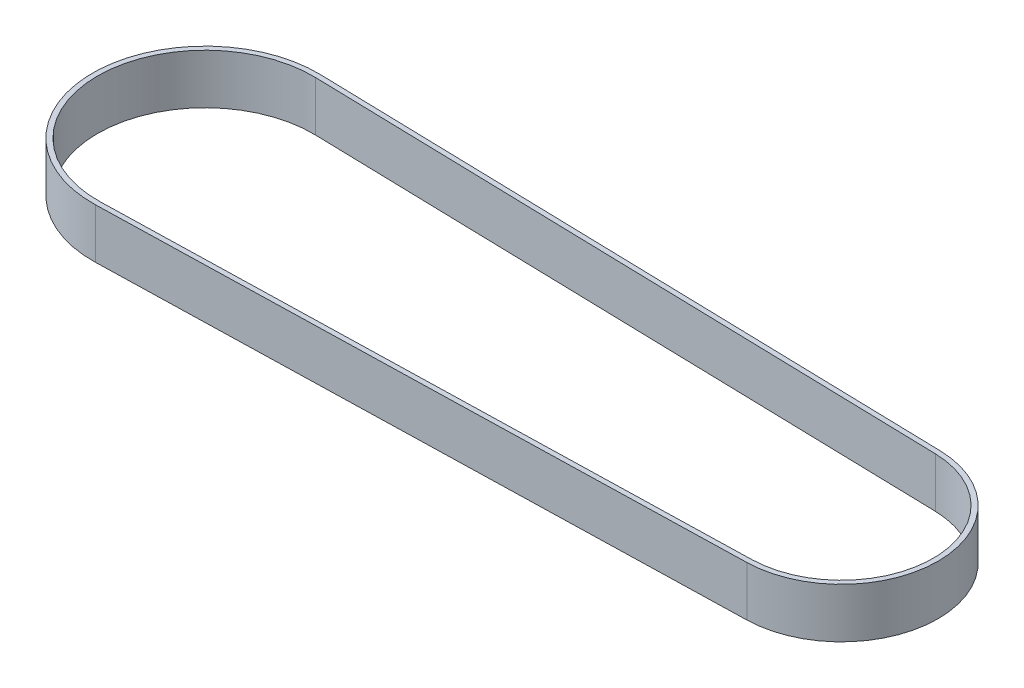
ISO-10303-21;
HEADER;
FILE_DESCRIPTION(('STEP AP214'),'2;1');
FILE_NAME('part.step','',(''),(''),'','','');
FILE_SCHEMA(('AUTOMOTIVE_DESIGN { 1 0 10303 214 1 1 1 1 }'));
ENDSEC;
DATA;
#1=APPLICATION_CONTEXT('core data for automotive mechanical design processes');
#2=APPLICATION_PROTOCOL_DEFINITION('international standard','automotive_design',2000,#1);
#3=PRODUCT_CONTEXT('',#1,'mechanical');
#4=PRODUCT('Part','Part','',(#3));
#5=PRODUCT_RELATED_PRODUCT_CATEGORY('part','',(#4));
#6=PRODUCT_DEFINITION_FORMATION('','',#4);
#7=PRODUCT_DEFINITION_CONTEXT('part definition',#1,'design');
#8=PRODUCT_DEFINITION('design','',#6,#7);
#9=PRODUCT_DEFINITION_SHAPE('','',#8);
#10=(LENGTH_UNIT() NAMED_UNIT(*) SI_UNIT(.MILLI.,.METRE.));
#11=(NAMED_UNIT(*) PLANE_ANGLE_UNIT() SI_UNIT($,.RADIAN.));
#12=(NAMED_UNIT(*) SI_UNIT($,.STERADIAN.) SOLID_ANGLE_UNIT());
#13=UNCERTAINTY_MEASURE_WITH_UNIT(LENGTH_MEASURE(1.E-05),#10,'distance_accuracy_value','');
#14=(GEOMETRIC_REPRESENTATION_CONTEXT(3) GLOBAL_UNCERTAINTY_ASSIGNED_CONTEXT((#13)) GLOBAL_UNIT_ASSIGNED_CONTEXT((#10,
#11,#12)) REPRESENTATION_CONTEXT('',''));
#15=CARTESIAN_POINT('',(0.,0.,0.));
#16=DIRECTION('',(0.,0.,1.));
#17=DIRECTION('',(1.,0.,0.));
#18=AXIS2_PLACEMENT_3D('',#15,#16,#17);
#19=CARTESIAN_POINT('',(0.,10.,0.));
#20=DIRECTION('',(0.,1.,0.));
#21=DIRECTION('',(0.,0.,1.));
#22=AXIS2_PLACEMENT_3D('',#19,#20,#21);
#23=PLANE('',#22);
#24=CARTESIAN_POINT('',(0.,10.,0.));
#25=DIRECTION('',(0.,1.,0.));
#26=DIRECTION('',(0.,0.,1.));
#27=AXIS2_PLACEMENT_3D('',#24,#25,#26);
#28=CIRCLE('',#27,22.6);
#29=CARTESIAN_POINT('',(0.566637937788921,10.,-22.5928953754816));
#30=VERTEX_POINT('',#29);
#31=CARTESIAN_POINT('',(0.566637937788921,10.,22.5928953754816));
#32=VERTEX_POINT('',#31);
#33=EDGE_CURVE('E153',#30,#32,#28,.T.);
#34=ORIENTED_EDGE('',*,*,#33,.T.);
#35=DIRECTION('',(0.999685636083257,0.,-0.0250724751234036));
#36=VECTOR('',#35,1.);
#37=CARTESIAN_POINT('',(0.566637937788921,10.,22.5928953754816));
#38=LINE('',#37,#36);
#39=CARTESIAN_POINT('',(128.116406017394,10.,19.3939013400152));
#40=VERTEX_POINT('',#39);
#41=EDGE_CURVE('E157',#32,#40,#38,.T.);
#42=ORIENTED_EDGE('',*,*,#41,.T.);
#43=CARTESIAN_POINT('',(127.63,10.,0.));
#44=DIRECTION('',(0.,1.,0.));
#45=DIRECTION('',(0.,0.,1.));
#46=AXIS2_PLACEMENT_3D('',#43,#44,#45);
#47=CIRCLE('',#46,19.4);
#48=CARTESIAN_POINT('',(128.116406017394,10.,-19.3939013400152));
#49=VERTEX_POINT('',#48);
#50=EDGE_CURVE('E161',#40,#49,#47,.T.);
#51=ORIENTED_EDGE('',*,*,#50,.T.);
#52=DIRECTION('',(-0.999685636083257,0.,-0.0250724751234036));
#53=VECTOR('',#52,1.);
#54=CARTESIAN_POINT('',(0.566637937788921,10.,-22.5928953754816));
#55=LINE('',#54,#53);
#56=EDGE_CURVE('E164',#49,#30,#55,.T.);
#57=ORIENTED_EDGE('',*,*,#56,.T.);
#58=EDGE_LOOP('',(#34,#42,#51,#57));
#59=FACE_BOUND('',#58,.T.);
#60=DIRECTION('',(0.999685636083257,0.,-0.0250724751234036));
#61=VECTOR('',#60,1.);
#62=CARTESIAN_POINT('',(0.541565462665518,10.,21.5932097393984));
#63=LINE('',#62,#61);
#64=CARTESIAN_POINT('',(0.541565462665518,10.,21.5932097393984));
#65=VERTEX_POINT('',#64);
#66=CARTESIAN_POINT('',(128.091333542271,10.,18.3942157039319));
#67=VERTEX_POINT('',#66);
#68=EDGE_CURVE('E114',#65,#67,#63,.T.);
#69=ORIENTED_EDGE('',*,*,#68,.F.);
#70=CARTESIAN_POINT('',(0.,10.,0.));
#71=DIRECTION('',(0.,1.,0.));
#72=DIRECTION('',(0.,0.,1.));
#73=AXIS2_PLACEMENT_3D('',#70,#71,#72);
#74=CIRCLE('',#73,21.6);
#75=CARTESIAN_POINT('',(0.541565462665518,10.,-21.5932097393984));
#76=VERTEX_POINT('',#75);
#77=EDGE_CURVE('E105',#76,#65,#74,.T.);
#78=ORIENTED_EDGE('',*,*,#77,.F.);
#79=DIRECTION('',(-0.999685636083257,0.,-0.0250724751234036));
#80=VECTOR('',#79,1.);
#81=CARTESIAN_POINT('',(0.541565462665518,10.,-21.5932097393984));
#82=LINE('',#81,#80);
#83=CARTESIAN_POINT('',(128.091333542271,10.,-18.3942157039319));
#84=VERTEX_POINT('',#83);
#85=EDGE_CURVE('E131',#84,#76,#82,.T.);
#86=ORIENTED_EDGE('',*,*,#85,.F.);
#87=CARTESIAN_POINT('',(127.63,10.,0.));
#88=DIRECTION('',(0.,1.,0.));
#89=DIRECTION('',(0.,0.,1.));
#90=AXIS2_PLACEMENT_3D('',#87,#88,#89);
#91=CIRCLE('',#90,18.4);
#92=EDGE_CURVE('E127',#67,#84,#91,.T.);
#93=ORIENTED_EDGE('',*,*,#92,.F.);
#94=EDGE_LOOP('',(#69,#78,#86,#93));
#95=FACE_BOUND('',#94,.T.);
#96=ADVANCED_FACE('F39',(#59,#95),#23,.T.);
#97=CARTESIAN_POINT('',(0.,0.,0.));
#98=DIRECTION('',(0.,1.,0.));
#99=DIRECTION('',(0.,0.,1.));
#100=AXIS2_PLACEMENT_3D('',#97,#98,#99);
#101=PLANE('',#100);
#102=CARTESIAN_POINT('',(0.,0.,0.));
#103=DIRECTION('',(0.,1.,0.));
#104=DIRECTION('',(0.,0.,1.));
#105=AXIS2_PLACEMENT_3D('',#102,#103,#104);
#106=CIRCLE('',#105,22.6);
#107=CARTESIAN_POINT('',(0.566637937788921,0.,-22.5928953754816));
#108=VERTEX_POINT('',#107);
#109=CARTESIAN_POINT('',(0.566637937788921,0.,22.5928953754816));
#110=VERTEX_POINT('',#109);
#111=EDGE_CURVE('E123',#108,#110,#106,.T.);
#112=ORIENTED_EDGE('',*,*,#111,.F.);
#113=DIRECTION('',(-0.999685636083257,0.,-0.0250724751234036));
#114=VECTOR('',#113,1.);
#115=CARTESIAN_POINT('',(0.566637937788921,0.,-22.5928953754816));
#116=LINE('',#115,#114);
#117=CARTESIAN_POINT('',(128.116406017394,0.,-19.3939013400152));
#118=VERTEX_POINT('',#117);
#119=EDGE_CURVE('E158',#118,#108,#116,.T.);
#120=ORIENTED_EDGE('',*,*,#119,.F.);
#121=CARTESIAN_POINT('',(127.63,0.,0.));
#122=DIRECTION('',(0.,1.,0.));
#123=DIRECTION('',(0.,0.,1.));
#124=AXIS2_PLACEMENT_3D('',#121,#122,#123);
#125=CIRCLE('',#124,19.4);
#126=CARTESIAN_POINT('',(128.116406017394,0.,19.3939013400152));
#127=VERTEX_POINT('',#126);
#128=EDGE_CURVE('E174',#127,#118,#125,.T.);
#129=ORIENTED_EDGE('',*,*,#128,.F.);
#130=DIRECTION('',(0.999685636083257,0.,-0.0250724751234036));
#131=VECTOR('',#130,1.);
#132=CARTESIAN_POINT('',(0.566637937788921,0.,22.5928953754816));
#133=LINE('',#132,#131);
#134=EDGE_CURVE('E171',#110,#127,#133,.T.);
#135=ORIENTED_EDGE('',*,*,#134,.F.);
#136=EDGE_LOOP('',(#112,#120,#129,#135));
#137=FACE_BOUND('',#136,.T.);
#138=CARTESIAN_POINT('',(0.,0.,0.));
#139=DIRECTION('',(0.,1.,0.));
#140=DIRECTION('',(0.,0.,1.));
#141=AXIS2_PLACEMENT_3D('',#138,#139,#140);
#142=CIRCLE('',#141,21.6);
#143=CARTESIAN_POINT('',(0.541565462665518,0.,-21.5932097393984));
#144=VERTEX_POINT('',#143);
#145=CARTESIAN_POINT('',(0.541565462665518,0.,21.5932097393984));
#146=VERTEX_POINT('',#145);
#147=EDGE_CURVE('E63',#144,#146,#142,.T.);
#148=ORIENTED_EDGE('',*,*,#147,.T.);
#149=DIRECTION('',(0.999685636083257,0.,-0.0250724751234036));
#150=VECTOR('',#149,1.);
#151=CARTESIAN_POINT('',(0.541565462665518,0.,21.5932097393984));
#152=LINE('',#151,#150);
#153=CARTESIAN_POINT('',(128.091333542271,0.,18.3942157039319));
#154=VERTEX_POINT('',#153);
#155=EDGE_CURVE('E121',#146,#154,#152,.T.);
#156=ORIENTED_EDGE('',*,*,#155,.T.);
#157=CARTESIAN_POINT('',(127.63,0.,0.));
#158=DIRECTION('',(0.,1.,0.));
#159=DIRECTION('',(0.,0.,1.));
#160=AXIS2_PLACEMENT_3D('',#157,#158,#159);
#161=CIRCLE('',#160,18.4);
#162=CARTESIAN_POINT('',(128.091333542271,0.,-18.3942157039319));
#163=VERTEX_POINT('',#162);
#164=EDGE_CURVE('E140',#154,#163,#161,.T.);
#165=ORIENTED_EDGE('',*,*,#164,.T.);
#166=DIRECTION('',(-0.999685636083257,0.,-0.0250724751234036));
#167=VECTOR('',#166,1.);
#168=CARTESIAN_POINT('',(0.541565462665518,0.,-21.5932097393984));
#169=LINE('',#168,#167);
#170=EDGE_CURVE('E115',#163,#144,#169,.T.);
#171=ORIENTED_EDGE('',*,*,#170,.T.);
#172=EDGE_LOOP('',(#148,#156,#165,#171));
#173=FACE_BOUND('',#172,.T.);
#174=ADVANCED_FACE('F197',(#137,#173),#101,.F.);
#175=CARTESIAN_POINT('',(0.,10.,0.));
#176=DIRECTION('',(0.,-1.,0.));
#177=DIRECTION('',(0.,0.,-1.));
#178=AXIS2_PLACEMENT_3D('',#175,#176,#177);
#179=CYLINDRICAL_SURFACE('',#178,22.6);
#180=ORIENTED_EDGE('',*,*,#111,.T.);
#181=DIRECTION('',(0.,-1.,0.));
#182=VECTOR('',#181,1.);
#183=CARTESIAN_POINT('',(0.566637937788921,10.,22.5928953754816));
#184=LINE('',#183,#182);
#185=EDGE_CURVE('E11',#32,#110,#184,.T.);
#186=ORIENTED_EDGE('',*,*,#185,.F.);
#187=ORIENTED_EDGE('',*,*,#33,.F.);
#188=DIRECTION('',(0.,-1.,0.));
#189=VECTOR('',#188,1.);
#190=CARTESIAN_POINT('',(0.566637937788921,10.,-22.5928953754816));
#191=LINE('',#190,#189);
#192=EDGE_CURVE('E167',#30,#108,#191,.T.);
#193=ORIENTED_EDGE('',*,*,#192,.T.);
#194=EDGE_LOOP('',(#180,#186,#187,#193));
#195=FACE_BOUND('',#194,.T.);
#196=ADVANCED_FACE('F41',(#195),#179,.T.);
#197=CARTESIAN_POINT('',(0.566637937788921,10.,22.5928953754816));
#198=DIRECTION('',(-0.0250724751234036,0.,-0.999685636083257));
#199=DIRECTION('',(-0.999685636083257,0.,0.0250724751234036));
#200=AXIS2_PLACEMENT_3D('',#197,#198,#199);
#201=PLANE('',#200);
#202=ORIENTED_EDGE('',*,*,#134,.T.);
#203=DIRECTION('',(0.,-1.,0.));
#204=VECTOR('',#203,1.);
#205=CARTESIAN_POINT('',(128.116406017394,10.,19.3939013400152));
#206=LINE('',#205,#204);
#207=EDGE_CURVE('E48',#40,#127,#206,.T.);
#208=ORIENTED_EDGE('',*,*,#207,.F.);
#209=ORIENTED_EDGE('',*,*,#41,.F.);
#210=ORIENTED_EDGE('',*,*,#185,.T.);
#211=EDGE_LOOP('',(#202,#208,#209,#210));
#212=FACE_BOUND('',#211,.T.);
#213=ADVANCED_FACE('F207',(#212),#201,.F.);
#214=CARTESIAN_POINT('',(127.63,10.,0.));
#215=DIRECTION('',(0.,-1.,0.));
#216=DIRECTION('',(0.,0.,-1.));
#217=AXIS2_PLACEMENT_3D('',#214,#215,#216);
#218=CYLINDRICAL_SURFACE('',#217,19.4);
#219=ORIENTED_EDGE('',*,*,#128,.T.);
#220=DIRECTION('',(0.,-1.,0.));
#221=VECTOR('',#220,1.);
#222=CARTESIAN_POINT('',(128.116406017394,10.,-19.3939013400152));
#223=LINE('',#222,#221);
#224=EDGE_CURVE('E182',#49,#118,#223,.T.);
#225=ORIENTED_EDGE('',*,*,#224,.F.);
#226=ORIENTED_EDGE('',*,*,#50,.F.);
#227=ORIENTED_EDGE('',*,*,#207,.T.);
#228=EDGE_LOOP('',(#219,#225,#226,#227));
#229=FACE_BOUND('',#228,.T.);
#230=ADVANCED_FACE('F191',(#229),#218,.T.);
#231=CARTESIAN_POINT('',(0.566637937788921,10.,-22.5928953754816));
#232=DIRECTION('',(-0.0250724751234036,0.,0.999685636083257));
#233=DIRECTION('',(0.999685636083257,0.,0.0250724751234036));
#234=AXIS2_PLACEMENT_3D('',#231,#232,#233);
#235=PLANE('',#234);
#236=ORIENTED_EDGE('',*,*,#119,.T.);
#237=ORIENTED_EDGE('',*,*,#192,.F.);
#238=ORIENTED_EDGE('',*,*,#56,.F.);
#239=ORIENTED_EDGE('',*,*,#224,.T.);
#240=EDGE_LOOP('',(#236,#237,#238,#239));
#241=FACE_BOUND('',#240,.T.);
#242=ADVANCED_FACE('F201',(#241),#235,.F.);
#243=CARTESIAN_POINT('',(0.,10.,0.));
#244=DIRECTION('',(0.,-1.,0.));
#245=DIRECTION('',(0.,0.,-1.));
#246=AXIS2_PLACEMENT_3D('',#243,#244,#245);
#247=CYLINDRICAL_SURFACE('',#246,21.6);
#248=ORIENTED_EDGE('',*,*,#147,.F.);
#249=DIRECTION('',(0.,-1.,0.));
#250=VECTOR('',#249,1.);
#251=CARTESIAN_POINT('',(0.541565462665518,10.,-21.5932097393984));
#252=LINE('',#251,#250);
#253=EDGE_CURVE('E109',#76,#144,#252,.T.);
#254=ORIENTED_EDGE('',*,*,#253,.F.);
#255=ORIENTED_EDGE('',*,*,#77,.T.);
#256=DIRECTION('',(0.,-1.,0.));
#257=VECTOR('',#256,1.);
#258=CARTESIAN_POINT('',(0.541565462665518,10.,21.5932097393984));
#259=LINE('',#258,#257);
#260=EDGE_CURVE('E108',#65,#146,#259,.T.);
#261=ORIENTED_EDGE('',*,*,#260,.T.);
#262=EDGE_LOOP('',(#248,#254,#255,#261));
#263=FACE_BOUND('',#262,.T.);
#264=ADVANCED_FACE('F107',(#263),#247,.F.);
#265=CARTESIAN_POINT('',(0.541565462665518,10.,21.5932097393984));
#266=DIRECTION('',(-0.0250724751234036,0.,-0.999685636083257));
#267=DIRECTION('',(-0.999685636083257,0.,0.0250724751234036));
#268=AXIS2_PLACEMENT_3D('',#265,#266,#267);
#269=PLANE('',#268);
#270=ORIENTED_EDGE('',*,*,#155,.F.);
#271=ORIENTED_EDGE('',*,*,#260,.F.);
#272=ORIENTED_EDGE('',*,*,#68,.T.);
#273=DIRECTION('',(0.,-1.,0.));
#274=VECTOR('',#273,1.);
#275=CARTESIAN_POINT('',(128.091333542271,10.,18.3942157039319));
#276=LINE('',#275,#274);
#277=EDGE_CURVE('E124',#67,#154,#276,.T.);
#278=ORIENTED_EDGE('',*,*,#277,.T.);
#279=EDGE_LOOP('',(#270,#271,#272,#278));
#280=FACE_BOUND('',#279,.T.);
#281=ADVANCED_FACE('F118',(#280),#269,.T.);
#282=CARTESIAN_POINT('',(127.63,10.,0.));
#283=DIRECTION('',(0.,-1.,0.));
#284=DIRECTION('',(0.,0.,-1.));
#285=AXIS2_PLACEMENT_3D('',#282,#283,#284);
#286=CYLINDRICAL_SURFACE('',#285,18.4);
#287=ORIENTED_EDGE('',*,*,#164,.F.);
#288=ORIENTED_EDGE('',*,*,#277,.F.);
#289=ORIENTED_EDGE('',*,*,#92,.T.);
#290=DIRECTION('',(0.,-1.,0.));
#291=VECTOR('',#290,1.);
#292=CARTESIAN_POINT('',(128.091333542271,10.,-18.3942157039319));
#293=LINE('',#292,#291);
#294=EDGE_CURVE('E55',#84,#163,#293,.T.);
#295=ORIENTED_EDGE('',*,*,#294,.T.);
#296=EDGE_LOOP('',(#287,#288,#289,#295));
#297=FACE_BOUND('',#296,.T.);
#298=ADVANCED_FACE('F230',(#297),#286,.F.);
#299=CARTESIAN_POINT('',(0.541565462665518,10.,-21.5932097393984));
#300=DIRECTION('',(-0.0250724751234036,0.,0.999685636083257));
#301=DIRECTION('',(0.999685636083257,0.,0.0250724751234036));
#302=AXIS2_PLACEMENT_3D('',#299,#300,#301);
#303=PLANE('',#302);
#304=ORIENTED_EDGE('',*,*,#170,.F.);
#305=ORIENTED_EDGE('',*,*,#294,.F.);
#306=ORIENTED_EDGE('',*,*,#85,.T.);
#307=ORIENTED_EDGE('',*,*,#253,.T.);
#308=EDGE_LOOP('',(#304,#305,#306,#307));
#309=FACE_BOUND('',#308,.T.);
#310=ADVANCED_FACE('F234',(#309),#303,.T.);
#311=CLOSED_SHELL('',(#96,#174,#196,#213,#230,#242,#264,#281,#298,#310));
#312=MANIFOLD_SOLID_BREP('B2',#311);
#313=ADVANCED_BREP_SHAPE_REPRESENTATION('',(#18,#312),#14);
#314=SHAPE_DEFINITION_REPRESENTATION(#9,#313);
ENDSEC;
END-ISO-10303-21;
